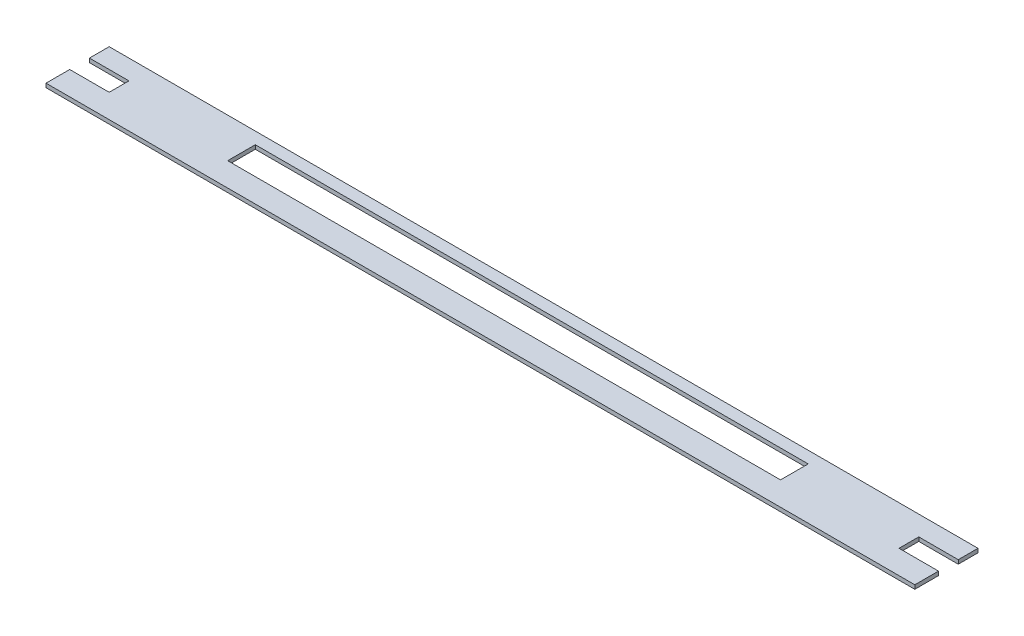
ISO-10303-21;
HEADER;
FILE_DESCRIPTION(('STEP AP214'),'2;1');
FILE_NAME('part.step','',(''),(''),'','','');
FILE_SCHEMA(('AUTOMOTIVE_DESIGN { 1 0 10303 214 1 1 1 1 }'));
ENDSEC;
DATA;
#1=APPLICATION_CONTEXT('core data for automotive mechanical design processes');
#2=APPLICATION_PROTOCOL_DEFINITION('international standard','automotive_design',2000,#1);
#3=PRODUCT_CONTEXT('',#1,'mechanical');
#4=PRODUCT('Part','Part','',(#3));
#5=PRODUCT_RELATED_PRODUCT_CATEGORY('part','',(#4));
#6=PRODUCT_DEFINITION_FORMATION('','',#4);
#7=PRODUCT_DEFINITION_CONTEXT('part definition',#1,'design');
#8=PRODUCT_DEFINITION('design','',#6,#7);
#9=PRODUCT_DEFINITION_SHAPE('','',#8);
#10=(LENGTH_UNIT() NAMED_UNIT(*) SI_UNIT(.MILLI.,.METRE.));
#11=(NAMED_UNIT(*) PLANE_ANGLE_UNIT() SI_UNIT($,.RADIAN.));
#12=(NAMED_UNIT(*) SI_UNIT($,.STERADIAN.) SOLID_ANGLE_UNIT());
#13=UNCERTAINTY_MEASURE_WITH_UNIT(LENGTH_MEASURE(1.E-05),#10,'distance_accuracy_value','');
#14=(GEOMETRIC_REPRESENTATION_CONTEXT(3) GLOBAL_UNCERTAINTY_ASSIGNED_CONTEXT((#13)) GLOBAL_UNIT_ASSIGNED_CONTEXT((#10,
#11,#12)) REPRESENTATION_CONTEXT('',''));
#15=CARTESIAN_POINT('',(0.,0.,0.));
#16=DIRECTION('',(0.,0.,1.));
#17=DIRECTION('',(1.,0.,0.));
#18=AXIS2_PLACEMENT_3D('',#15,#16,#17);
#19=CARTESIAN_POINT('',(597.266258042068,0.,0.));
#20=DIRECTION('',(1.,0.,0.));
#21=DIRECTION('',(0.,0.,-1.));
#22=AXIS2_PLACEMENT_3D('',#19,#20,#21);
#23=PLANE('',#22);
#24=DIRECTION('',(0.,-1.,0.));
#25=VECTOR('',#24,1.);
#26=CARTESIAN_POINT('',(597.266258042068,50.,50.));
#27=LINE('',#26,#25);
#28=CARTESIAN_POINT('',(597.266258042068,50.,50.));
#29=VERTEX_POINT('',#28);
#30=CARTESIAN_POINT('',(597.266258042068,45.,50.));
#31=VERTEX_POINT('',#30);
#32=EDGE_CURVE('E171',#29,#31,#27,.T.);
#33=ORIENTED_EDGE('',*,*,#32,.F.);
#34=DIRECTION('',(0.,0.,-1.));
#35=VECTOR('',#34,1.);
#36=CARTESIAN_POINT('',(597.266258042068,50.,80.));
#37=LINE('',#36,#35);
#38=CARTESIAN_POINT('',(597.266258042068,50.,80.));
#39=VERTEX_POINT('',#38);
#40=EDGE_CURVE('E161',#39,#29,#37,.T.);
#41=ORIENTED_EDGE('',*,*,#40,.F.);
#42=DIRECTION('',(0.,1.,0.));
#43=VECTOR('',#42,1.);
#44=CARTESIAN_POINT('',(597.266258042068,0.,80.));
#45=LINE('',#44,#43);
#46=CARTESIAN_POINT('',(597.266258042068,45.,80.));
#47=VERTEX_POINT('',#46);
#48=EDGE_CURVE('E162',#47,#39,#45,.T.);
#49=ORIENTED_EDGE('',*,*,#48,.F.);
#50=DIRECTION('',(0.,0.,-1.));
#51=VECTOR('',#50,1.);
#52=CARTESIAN_POINT('',(597.266258042068,45.,80.));
#53=LINE('',#52,#51);
#54=EDGE_CURVE('E36',#47,#31,#53,.T.);
#55=ORIENTED_EDGE('',*,*,#54,.T.);
#56=EDGE_LOOP('',(#33,#41,#49,#55));
#57=FACE_BOUND('',#56,.T.);
#58=ADVANCED_FACE('F32',(#57),#23,.T.);
#59=CARTESIAN_POINT('',(-502.733741957931,0.,0.));
#60=DIRECTION('',(1.,0.,0.));
#61=DIRECTION('',(0.,0.,-1.));
#62=AXIS2_PLACEMENT_3D('',#59,#60,#61);
#63=PLANE('',#62);
#64=DIRECTION('',(0.,0.,-1.));
#65=VECTOR('',#64,1.);
#66=CARTESIAN_POINT('',(-502.733741957931,45.,80.));
#67=LINE('',#66,#65);
#68=CARTESIAN_POINT('',(-502.733741957931,45.,25.));
#69=VERTEX_POINT('',#68);
#70=CARTESIAN_POINT('',(-502.733741957931,45.,0.));
#71=VERTEX_POINT('',#70);
#72=EDGE_CURVE('E261',#69,#71,#67,.T.);
#73=ORIENTED_EDGE('',*,*,#72,.F.);
#74=DIRECTION('',(0.,-1.,0.));
#75=VECTOR('',#74,1.);
#76=CARTESIAN_POINT('',(-502.733741957931,50.,25.));
#77=LINE('',#76,#75);
#78=CARTESIAN_POINT('',(-502.733741957931,50.,25.));
#79=VERTEX_POINT('',#78);
#80=EDGE_CURVE('E196',#79,#69,#77,.T.);
#81=ORIENTED_EDGE('',*,*,#80,.F.);
#82=DIRECTION('',(0.,0.,-1.));
#83=VECTOR('',#82,1.);
#84=CARTESIAN_POINT('',(-502.733741957931,50.,80.));
#85=LINE('',#84,#83);
#86=CARTESIAN_POINT('',(-502.733741957931,50.,0.));
#87=VERTEX_POINT('',#86);
#88=EDGE_CURVE('E41',#79,#87,#85,.T.);
#89=ORIENTED_EDGE('',*,*,#88,.T.);
#90=DIRECTION('',(0.,1.,0.));
#91=VECTOR('',#90,1.);
#92=CARTESIAN_POINT('',(-502.733741957931,0.,0.));
#93=LINE('',#92,#91);
#94=EDGE_CURVE('E172',#71,#87,#93,.T.);
#95=ORIENTED_EDGE('',*,*,#94,.F.);
#96=EDGE_LOOP('',(#73,#81,#89,#95));
#97=FACE_BOUND('',#96,.T.);
#98=ADVANCED_FACE('F297',(#97),#63,.F.);
#99=CARTESIAN_POINT('',(597.266258042068,45.,5.));
#100=DIRECTION('',(0.,-1.,0.));
#101=DIRECTION('',(0.,0.,-1.));
#102=AXIS2_PLACEMENT_3D('',#99,#100,#101);
#103=PLANE('',#102);
#104=DIRECTION('',(1.,0.,0.));
#105=VECTOR('',#104,1.);
#106=CARTESIAN_POINT('',(547.266258042068,45.,50.));
#107=LINE('',#106,#105);
#108=CARTESIAN_POINT('',(547.266258042068,45.,50.));
#109=VERTEX_POINT('',#108);
#110=EDGE_CURVE('E191',#109,#31,#107,.T.);
#111=ORIENTED_EDGE('',*,*,#110,.T.);
#112=ORIENTED_EDGE('',*,*,#54,.F.);
#113=DIRECTION('',(-1.,0.,0.));
#114=VECTOR('',#113,1.);
#115=CARTESIAN_POINT('',(-502.733741957931,45.,80.));
#116=LINE('',#115,#114);
#117=CARTESIAN_POINT('',(-502.733741957931,45.,80.));
#118=VERTEX_POINT('',#117);
#119=EDGE_CURVE('E256',#47,#118,#116,.T.);
#120=ORIENTED_EDGE('',*,*,#119,.T.);
#121=CARTESIAN_POINT('',(-502.733741957931,45.,50.));
#122=VERTEX_POINT('',#121);
#123=EDGE_CURVE('E264',#118,#122,#67,.T.);
#124=ORIENTED_EDGE('',*,*,#123,.T.);
#125=DIRECTION('',(-1.,0.,0.));
#126=VECTOR('',#125,1.);
#127=CARTESIAN_POINT('',(-452.733741957932,45.,50.));
#128=LINE('',#127,#126);
#129=CARTESIAN_POINT('',(-452.733741957932,45.,50.));
#130=VERTEX_POINT('',#129);
#131=EDGE_CURVE('E220',#130,#122,#128,.T.);
#132=ORIENTED_EDGE('',*,*,#131,.F.);
#133=DIRECTION('',(0.,0.,1.));
#134=VECTOR('',#133,1.);
#135=CARTESIAN_POINT('',(-452.733741957932,45.,25.));
#136=LINE('',#135,#134);
#137=CARTESIAN_POINT('',(-452.733741957932,45.,25.));
#138=VERTEX_POINT('',#137);
#139=EDGE_CURVE('E205',#138,#130,#136,.T.);
#140=ORIENTED_EDGE('',*,*,#139,.F.);
#141=DIRECTION('',(-1.,0.,0.));
#142=VECTOR('',#141,1.);
#143=CARTESIAN_POINT('',(-452.733741957932,45.,25.));
#144=LINE('',#143,#142);
#145=EDGE_CURVE('E211',#138,#69,#144,.T.);
#146=ORIENTED_EDGE('',*,*,#145,.T.);
#147=ORIENTED_EDGE('',*,*,#72,.T.);
#148=DIRECTION('',(1.,0.,0.));
#149=VECTOR('',#148,1.);
#150=CARTESIAN_POINT('',(-502.733741957931,45.,0.));
#151=LINE('',#150,#149);
#152=CARTESIAN_POINT('',(597.266258042068,45.,0.));
#153=VERTEX_POINT('',#152);
#154=EDGE_CURVE('E177',#71,#153,#151,.T.);
#155=ORIENTED_EDGE('',*,*,#154,.T.);
#156=CARTESIAN_POINT('',(597.266258042068,45.,25.));
#157=VERTEX_POINT('',#156);
#158=EDGE_CURVE('E167',#157,#153,#53,.T.);
#159=ORIENTED_EDGE('',*,*,#158,.F.);
#160=DIRECTION('',(1.,0.,0.));
#161=VECTOR('',#160,1.);
#162=CARTESIAN_POINT('',(547.266258042068,45.,25.));
#163=LINE('',#162,#161);
#164=CARTESIAN_POINT('',(547.266258042068,45.,25.));
#165=VERTEX_POINT('',#164);
#166=EDGE_CURVE('E198',#165,#157,#163,.T.);
#167=ORIENTED_EDGE('',*,*,#166,.F.);
#168=DIRECTION('',(0.,0.,-1.));
#169=VECTOR('',#168,1.);
#170=CARTESIAN_POINT('',(547.266258042068,45.,50.));
#171=LINE('',#170,#169);
#172=EDGE_CURVE('E185',#109,#165,#171,.T.);
#173=ORIENTED_EDGE('',*,*,#172,.F.);
#174=EDGE_LOOP('',(#111,#112,#120,#124,#132,#140,#146,#147,#155,#159,#167,#173));
#175=FACE_BOUND('',#174,.T.);
#176=DIRECTION('',(0.,0.,-1.));
#177=VECTOR('',#176,1.);
#178=CARTESIAN_POINT('',(-302.733741957932,45.,5.));
#179=LINE('',#178,#177);
#180=CARTESIAN_POINT('',(-302.733741957931,45.,50.));
#181=VERTEX_POINT('',#180);
#182=CARTESIAN_POINT('',(-302.733741957931,45.,15.));
#183=VERTEX_POINT('',#182);
#184=EDGE_CURVE('E250',#181,#183,#179,.T.);
#185=ORIENTED_EDGE('',*,*,#184,.F.);
#186=DIRECTION('',(-1.,0.,0.));
#187=VECTOR('',#186,1.);
#188=CARTESIAN_POINT('',(597.266258042068,45.,50.));
#189=LINE('',#188,#187);
#190=CARTESIAN_POINT('',(397.266258042068,45.,50.));
#191=VERTEX_POINT('',#190);
#192=EDGE_CURVE('E237',#191,#181,#189,.T.);
#193=ORIENTED_EDGE('',*,*,#192,.F.);
#194=DIRECTION('',(0.,0.,1.));
#195=VECTOR('',#194,1.);
#196=CARTESIAN_POINT('',(397.266258042068,45.,5.));
#197=LINE('',#196,#195);
#198=CARTESIAN_POINT('',(397.266258042068,45.,15.));
#199=VERTEX_POINT('',#198);
#200=EDGE_CURVE('E245',#199,#191,#197,.T.);
#201=ORIENTED_EDGE('',*,*,#200,.F.);
#202=DIRECTION('',(1.,0.,0.));
#203=VECTOR('',#202,1.);
#204=CARTESIAN_POINT('',(597.266258042068,45.,15.));
#205=LINE('',#204,#203);
#206=EDGE_CURVE('E248',#183,#199,#205,.T.);
#207=ORIENTED_EDGE('',*,*,#206,.F.);
#208=EDGE_LOOP('',(#185,#193,#201,#207));
#209=FACE_BOUND('',#208,.T.);
#210=ADVANCED_FACE('F277',(#175,#209),#103,.T.);
#211=DIRECTION('',(0.,1.,0.));
#212=VECTOR('',#211,1.);
#213=CARTESIAN_POINT('',(597.266258042068,50.,25.));
#214=LINE('',#213,#212);
#215=CARTESIAN_POINT('',(597.266258042068,50.,25.));
#216=VERTEX_POINT('',#215);
#217=EDGE_CURVE('E186',#157,#216,#214,.T.);
#218=ORIENTED_EDGE('',*,*,#217,.F.);
#219=ORIENTED_EDGE('',*,*,#158,.T.);
#220=DIRECTION('',(0.,-1.,0.));
#221=VECTOR('',#220,1.);
#222=CARTESIAN_POINT('',(597.266258042068,0.,0.));
#223=LINE('',#222,#221);
#224=CARTESIAN_POINT('',(597.266258042068,50.,0.));
#225=VERTEX_POINT('',#224);
#226=EDGE_CURVE('E164',#225,#153,#223,.T.);
#227=ORIENTED_EDGE('',*,*,#226,.F.);
#228=EDGE_CURVE('E150',#216,#225,#37,.T.);
#229=ORIENTED_EDGE('',*,*,#228,.F.);
#230=EDGE_LOOP('',(#218,#219,#227,#229));
#231=FACE_BOUND('',#230,.T.);
#232=ADVANCED_FACE('F165',(#231),#23,.T.);
#233=CARTESIAN_POINT('',(-502.733741957931,0.,80.));
#234=DIRECTION('',(0.,0.,1.));
#235=DIRECTION('',(1.,0.,0.));
#236=AXIS2_PLACEMENT_3D('',#233,#234,#235);
#237=PLANE('',#236);
#238=DIRECTION('',(0.,1.,0.));
#239=VECTOR('',#238,1.);
#240=CARTESIAN_POINT('',(-502.733741957931,0.,80.));
#241=LINE('',#240,#239);
#242=CARTESIAN_POINT('',(-502.733741957931,50.,80.));
#243=VERTEX_POINT('',#242);
#244=EDGE_CURVE('E254',#118,#243,#241,.T.);
#245=ORIENTED_EDGE('',*,*,#244,.F.);
#246=ORIENTED_EDGE('',*,*,#119,.F.);
#247=ORIENTED_EDGE('',*,*,#48,.T.);
#248=DIRECTION('',(-1.,0.,0.));
#249=VECTOR('',#248,1.);
#250=CARTESIAN_POINT('',(-502.733741957931,50.,80.));
#251=LINE('',#250,#249);
#252=EDGE_CURVE('E258',#39,#243,#251,.T.);
#253=ORIENTED_EDGE('',*,*,#252,.T.);
#254=EDGE_LOOP('',(#245,#246,#247,#253));
#255=FACE_BOUND('',#254,.T.);
#256=ADVANCED_FACE('F274',(#255),#237,.T.);
#257=CARTESIAN_POINT('',(-502.733741957931,50.,50.));
#258=VERTEX_POINT('',#257);
#259=EDGE_CURVE('E11',#243,#258,#85,.T.);
#260=ORIENTED_EDGE('',*,*,#259,.T.);
#261=DIRECTION('',(0.,1.,0.));
#262=VECTOR('',#261,1.);
#263=CARTESIAN_POINT('',(-502.733741957931,50.,50.));
#264=LINE('',#263,#262);
#265=EDGE_CURVE('E206',#122,#258,#264,.T.);
#266=ORIENTED_EDGE('',*,*,#265,.F.);
#267=ORIENTED_EDGE('',*,*,#123,.F.);
#268=ORIENTED_EDGE('',*,*,#244,.T.);
#269=EDGE_LOOP('',(#260,#266,#267,#268));
#270=FACE_BOUND('',#269,.T.);
#271=ADVANCED_FACE('F304',(#270),#63,.F.);
#272=CARTESIAN_POINT('',(-502.733741957931,50.,80.));
#273=DIRECTION('',(0.,-1.,0.));
#274=DIRECTION('',(0.,0.,-1.));
#275=AXIS2_PLACEMENT_3D('',#272,#273,#274);
#276=PLANE('',#275);
#277=ORIENTED_EDGE('',*,*,#40,.T.);
#278=DIRECTION('',(1.,0.,0.));
#279=VECTOR('',#278,1.);
#280=CARTESIAN_POINT('',(547.266258042068,50.,50.));
#281=LINE('',#280,#279);
#282=CARTESIAN_POINT('',(547.266258042068,50.,50.));
#283=VERTEX_POINT('',#282);
#284=EDGE_CURVE('E194',#283,#29,#281,.T.);
#285=ORIENTED_EDGE('',*,*,#284,.F.);
#286=DIRECTION('',(0.,0.,1.));
#287=VECTOR('',#286,1.);
#288=CARTESIAN_POINT('',(547.266258042068,50.,50.));
#289=LINE('',#288,#287);
#290=CARTESIAN_POINT('',(547.266258042068,50.,25.));
#291=VERTEX_POINT('',#290);
#292=EDGE_CURVE('E189',#291,#283,#289,.T.);
#293=ORIENTED_EDGE('',*,*,#292,.F.);
#294=DIRECTION('',(1.,0.,0.));
#295=VECTOR('',#294,1.);
#296=CARTESIAN_POINT('',(547.266258042068,50.,25.));
#297=LINE('',#296,#295);
#298=EDGE_CURVE('E158',#291,#216,#297,.T.);
#299=ORIENTED_EDGE('',*,*,#298,.T.);
#300=ORIENTED_EDGE('',*,*,#228,.T.);
#301=DIRECTION('',(-1.,0.,0.));
#302=VECTOR('',#301,1.);
#303=CARTESIAN_POINT('',(-502.733741957931,50.,0.));
#304=LINE('',#303,#302);
#305=EDGE_CURVE('E156',#225,#87,#304,.T.);
#306=ORIENTED_EDGE('',*,*,#305,.T.);
#307=ORIENTED_EDGE('',*,*,#88,.F.);
#308=DIRECTION('',(-1.,0.,0.));
#309=VECTOR('',#308,1.);
#310=CARTESIAN_POINT('',(-452.733741957932,50.,25.));
#311=LINE('',#310,#309);
#312=CARTESIAN_POINT('',(-452.733741957932,50.,25.));
#313=VERTEX_POINT('',#312);
#314=EDGE_CURVE('E214',#313,#79,#311,.T.);
#315=ORIENTED_EDGE('',*,*,#314,.F.);
#316=DIRECTION('',(0.,0.,-1.));
#317=VECTOR('',#316,1.);
#318=CARTESIAN_POINT('',(-452.733741957932,50.,25.));
#319=LINE('',#318,#317);
#320=CARTESIAN_POINT('',(-452.733741957932,50.,50.));
#321=VERTEX_POINT('',#320);
#322=EDGE_CURVE('E209',#321,#313,#319,.T.);
#323=ORIENTED_EDGE('',*,*,#322,.F.);
#324=DIRECTION('',(-1.,0.,0.));
#325=VECTOR('',#324,1.);
#326=CARTESIAN_POINT('',(-452.733741957932,50.,50.));
#327=LINE('',#326,#325);
#328=EDGE_CURVE('E217',#321,#258,#327,.T.);
#329=ORIENTED_EDGE('',*,*,#328,.T.);
#330=ORIENTED_EDGE('',*,*,#259,.F.);
#331=ORIENTED_EDGE('',*,*,#252,.F.);
#332=EDGE_LOOP('',(#277,#285,#293,#299,#300,#306,#307,#315,#323,#329,#330,#331));
#333=FACE_BOUND('',#332,.T.);
#334=DIRECTION('',(1.,0.,0.));
#335=VECTOR('',#334,1.);
#336=CARTESIAN_POINT('',(-302.733741957931,50.,50.));
#337=LINE('',#336,#335);
#338=CARTESIAN_POINT('',(-302.733741957931,50.,50.));
#339=VERTEX_POINT('',#338);
#340=CARTESIAN_POINT('',(397.266258042068,50.,50.));
#341=VERTEX_POINT('',#340);
#342=EDGE_CURVE('E225',#339,#341,#337,.T.);
#343=ORIENTED_EDGE('',*,*,#342,.F.);
#344=DIRECTION('',(0.,0.,1.));
#345=VECTOR('',#344,1.);
#346=CARTESIAN_POINT('',(-302.733741957931,50.,15.));
#347=LINE('',#346,#345);
#348=CARTESIAN_POINT('',(-302.733741957931,50.,15.));
#349=VERTEX_POINT('',#348);
#350=EDGE_CURVE('E216',#349,#339,#347,.T.);
#351=ORIENTED_EDGE('',*,*,#350,.F.);
#352=DIRECTION('',(-1.,0.,0.));
#353=VECTOR('',#352,1.);
#354=CARTESIAN_POINT('',(-302.733741957931,50.,15.));
#355=LINE('',#354,#353);
#356=CARTESIAN_POINT('',(397.266258042068,50.,15.));
#357=VERTEX_POINT('',#356);
#358=EDGE_CURVE('E231',#357,#349,#355,.T.);
#359=ORIENTED_EDGE('',*,*,#358,.F.);
#360=DIRECTION('',(0.,0.,-1.));
#361=VECTOR('',#360,1.);
#362=CARTESIAN_POINT('',(397.266258042068,50.,15.));
#363=LINE('',#362,#361);
#364=EDGE_CURVE('E228',#341,#357,#363,.T.);
#365=ORIENTED_EDGE('',*,*,#364,.F.);
#366=EDGE_LOOP('',(#343,#351,#359,#365));
#367=FACE_BOUND('',#366,.T.);
#368=ADVANCED_FACE('F34',(#333,#367),#276,.F.);
#369=CARTESIAN_POINT('',(-302.733741957931,40.,15.));
#370=DIRECTION('',(-1.,0.,0.));
#371=DIRECTION('',(0.,0.,1.));
#372=AXIS2_PLACEMENT_3D('',#369,#370,#371);
#373=PLANE('',#372);
#374=ORIENTED_EDGE('',*,*,#184,.T.);
#375=DIRECTION('',(0.,1.,0.));
#376=VECTOR('',#375,1.);
#377=CARTESIAN_POINT('',(-302.733741957931,40.,15.));
#378=LINE('',#377,#376);
#379=EDGE_CURVE('E235',#183,#349,#378,.T.);
#380=ORIENTED_EDGE('',*,*,#379,.T.);
#381=ORIENTED_EDGE('',*,*,#350,.T.);
#382=DIRECTION('',(0.,1.,0.));
#383=VECTOR('',#382,1.);
#384=CARTESIAN_POINT('',(-302.733741957931,40.,50.));
#385=LINE('',#384,#383);
#386=EDGE_CURVE('E234',#181,#339,#385,.T.);
#387=ORIENTED_EDGE('',*,*,#386,.F.);
#388=EDGE_LOOP('',(#374,#380,#381,#387));
#389=FACE_BOUND('',#388,.T.);
#390=ADVANCED_FACE('F319',(#389),#373,.F.);
#391=CARTESIAN_POINT('',(-302.733741957931,40.,15.));
#392=DIRECTION('',(0.,0.,-1.));
#393=DIRECTION('',(-1.,0.,0.));
#394=AXIS2_PLACEMENT_3D('',#391,#392,#393);
#395=PLANE('',#394);
#396=ORIENTED_EDGE('',*,*,#206,.T.);
#397=DIRECTION('',(0.,1.,0.));
#398=VECTOR('',#397,1.);
#399=CARTESIAN_POINT('',(397.266258042068,40.,15.));
#400=LINE('',#399,#398);
#401=EDGE_CURVE('E238',#199,#357,#400,.T.);
#402=ORIENTED_EDGE('',*,*,#401,.T.);
#403=ORIENTED_EDGE('',*,*,#358,.T.);
#404=ORIENTED_EDGE('',*,*,#379,.F.);
#405=EDGE_LOOP('',(#396,#402,#403,#404));
#406=FACE_BOUND('',#405,.T.);
#407=ADVANCED_FACE('F343',(#406),#395,.F.);
#408=CARTESIAN_POINT('',(397.266258042068,40.,15.));
#409=DIRECTION('',(1.,0.,0.));
#410=DIRECTION('',(0.,0.,-1.));
#411=AXIS2_PLACEMENT_3D('',#408,#409,#410);
#412=PLANE('',#411);
#413=ORIENTED_EDGE('',*,*,#200,.T.);
#414=DIRECTION('',(0.,1.,0.));
#415=VECTOR('',#414,1.);
#416=CARTESIAN_POINT('',(397.266258042068,40.,50.));
#417=LINE('',#416,#415);
#418=EDGE_CURVE('E240',#191,#341,#417,.T.);
#419=ORIENTED_EDGE('',*,*,#418,.T.);
#420=ORIENTED_EDGE('',*,*,#364,.T.);
#421=ORIENTED_EDGE('',*,*,#401,.F.);
#422=EDGE_LOOP('',(#413,#419,#420,#421));
#423=FACE_BOUND('',#422,.T.);
#424=ADVANCED_FACE('F338',(#423),#412,.F.);
#425=CARTESIAN_POINT('',(-302.733741957931,40.,50.));
#426=DIRECTION('',(0.,0.,1.));
#427=DIRECTION('',(1.,0.,0.));
#428=AXIS2_PLACEMENT_3D('',#425,#426,#427);
#429=PLANE('',#428);
#430=ORIENTED_EDGE('',*,*,#192,.T.);
#431=ORIENTED_EDGE('',*,*,#386,.T.);
#432=ORIENTED_EDGE('',*,*,#342,.T.);
#433=ORIENTED_EDGE('',*,*,#418,.F.);
#434=EDGE_LOOP('',(#430,#431,#432,#433));
#435=FACE_BOUND('',#434,.T.);
#436=ADVANCED_FACE('F331',(#435),#429,.F.);
#437=CARTESIAN_POINT('',(-452.733741957932,50.,25.));
#438=DIRECTION('',(0.,0.,-1.));
#439=DIRECTION('',(-1.,0.,0.));
#440=AXIS2_PLACEMENT_3D('',#437,#438,#439);
#441=PLANE('',#440);
#442=ORIENTED_EDGE('',*,*,#80,.T.);
#443=ORIENTED_EDGE('',*,*,#145,.F.);
#444=DIRECTION('',(0.,-1.,0.));
#445=VECTOR('',#444,1.);
#446=CARTESIAN_POINT('',(-452.733741957932,50.,25.));
#447=LINE('',#446,#445);
#448=EDGE_CURVE('E202',#313,#138,#447,.T.);
#449=ORIENTED_EDGE('',*,*,#448,.F.);
#450=ORIENTED_EDGE('',*,*,#314,.T.);
#451=EDGE_LOOP('',(#442,#443,#449,#450));
#452=FACE_BOUND('',#451,.T.);
#453=ADVANCED_FACE('F328',(#452),#441,.F.);
#454=CARTESIAN_POINT('',(-452.733741957932,50.,50.));
#455=DIRECTION('',(0.,0.,1.));
#456=DIRECTION('',(1.,0.,0.));
#457=AXIS2_PLACEMENT_3D('',#454,#455,#456);
#458=PLANE('',#457);
#459=ORIENTED_EDGE('',*,*,#265,.T.);
#460=ORIENTED_EDGE('',*,*,#328,.F.);
#461=DIRECTION('',(0.,1.,0.));
#462=VECTOR('',#461,1.);
#463=CARTESIAN_POINT('',(-452.733741957932,50.,50.));
#464=LINE('',#463,#462);
#465=EDGE_CURVE('E57',#130,#321,#464,.T.);
#466=ORIENTED_EDGE('',*,*,#465,.F.);
#467=ORIENTED_EDGE('',*,*,#131,.T.);
#468=EDGE_LOOP('',(#459,#460,#466,#467));
#469=FACE_BOUND('',#468,.T.);
#470=ADVANCED_FACE('F324',(#469),#458,.F.);
#471=CARTESIAN_POINT('',(-452.733741957932,0.,0.));
#472=DIRECTION('',(-1.,0.,0.));
#473=DIRECTION('',(0.,0.,1.));
#474=AXIS2_PLACEMENT_3D('',#471,#472,#473);
#475=PLANE('',#474);
#476=ORIENTED_EDGE('',*,*,#448,.T.);
#477=ORIENTED_EDGE('',*,*,#139,.T.);
#478=ORIENTED_EDGE('',*,*,#465,.T.);
#479=ORIENTED_EDGE('',*,*,#322,.T.);
#480=EDGE_LOOP('',(#476,#477,#478,#479));
#481=FACE_BOUND('',#480,.T.);
#482=ADVANCED_FACE('F294',(#481),#475,.T.);
#483=CARTESIAN_POINT('',(547.266258042068,50.,50.));
#484=DIRECTION('',(0.,0.,1.));
#485=DIRECTION('',(1.,0.,0.));
#486=AXIS2_PLACEMENT_3D('',#483,#484,#485);
#487=PLANE('',#486);
#488=ORIENTED_EDGE('',*,*,#32,.T.);
#489=ORIENTED_EDGE('',*,*,#110,.F.);
#490=DIRECTION('',(0.,-1.,0.));
#491=VECTOR('',#490,1.);
#492=CARTESIAN_POINT('',(547.266258042068,50.,50.));
#493=LINE('',#492,#491);
#494=EDGE_CURVE('E182',#283,#109,#493,.T.);
#495=ORIENTED_EDGE('',*,*,#494,.F.);
#496=ORIENTED_EDGE('',*,*,#284,.T.);
#497=EDGE_LOOP('',(#488,#489,#495,#496));
#498=FACE_BOUND('',#497,.T.);
#499=ADVANCED_FACE('F283',(#498),#487,.F.);
#500=CARTESIAN_POINT('',(547.266258042068,50.,25.));
#501=DIRECTION('',(0.,0.,-1.));
#502=DIRECTION('',(-1.,0.,0.));
#503=AXIS2_PLACEMENT_3D('',#500,#501,#502);
#504=PLANE('',#503);
#505=ORIENTED_EDGE('',*,*,#217,.T.);
#506=ORIENTED_EDGE('',*,*,#298,.F.);
#507=DIRECTION('',(0.,1.,0.));
#508=VECTOR('',#507,1.);
#509=CARTESIAN_POINT('',(547.266258042068,50.,25.));
#510=LINE('',#509,#508);
#511=EDGE_CURVE('E49',#165,#291,#510,.T.);
#512=ORIENTED_EDGE('',*,*,#511,.F.);
#513=ORIENTED_EDGE('',*,*,#166,.T.);
#514=EDGE_LOOP('',(#505,#506,#512,#513));
#515=FACE_BOUND('',#514,.T.);
#516=ADVANCED_FACE('F286',(#515),#504,.F.);
#517=CARTESIAN_POINT('',(547.266258042068,0.,0.));
#518=DIRECTION('',(1.,0.,0.));
#519=DIRECTION('',(0.,0.,-1.));
#520=AXIS2_PLACEMENT_3D('',#517,#518,#519);
#521=PLANE('',#520);
#522=ORIENTED_EDGE('',*,*,#494,.T.);
#523=ORIENTED_EDGE('',*,*,#172,.T.);
#524=ORIENTED_EDGE('',*,*,#511,.T.);
#525=ORIENTED_EDGE('',*,*,#292,.T.);
#526=EDGE_LOOP('',(#522,#523,#524,#525));
#527=FACE_BOUND('',#526,.T.);
#528=ADVANCED_FACE('F284',(#527),#521,.T.);
#529=CARTESIAN_POINT('',(-502.733741957931,0.,0.));
#530=DIRECTION('',(0.,0.,1.));
#531=DIRECTION('',(1.,0.,0.));
#532=AXIS2_PLACEMENT_3D('',#529,#530,#531);
#533=PLANE('',#532);
#534=ORIENTED_EDGE('',*,*,#305,.F.);
#535=ORIENTED_EDGE('',*,*,#226,.T.);
#536=ORIENTED_EDGE('',*,*,#154,.F.);
#537=ORIENTED_EDGE('',*,*,#94,.T.);
#538=EDGE_LOOP('',(#534,#535,#536,#537));
#539=FACE_BOUND('',#538,.T.);
#540=ADVANCED_FACE('F175',(#539),#533,.F.);
#541=CLOSED_SHELL('',(#58,#98,#210,#232,#256,#271,#368,#390,#407,#424,#436,#453,#470,#482,#499,
#516,#528,#540));
#542=MANIFOLD_SOLID_BREP('B2',#541);
#543=ADVANCED_BREP_SHAPE_REPRESENTATION('',(#18,#542),#14);
#544=SHAPE_DEFINITION_REPRESENTATION(#9,#543);
ENDSEC;
END-ISO-10303-21;
